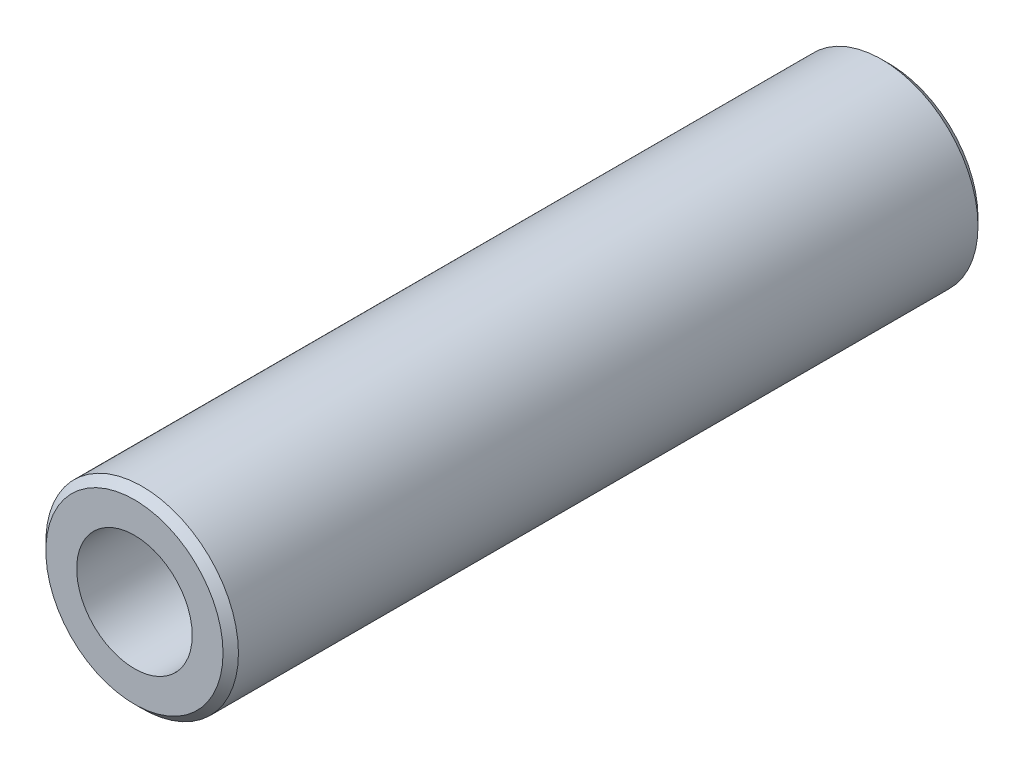
ISO-10303-21;
HEADER;
FILE_DESCRIPTION(('STEP AP214'),'2;1');
FILE_NAME('part.step','',(''),(''),'','','');
FILE_SCHEMA(('AUTOMOTIVE_DESIGN { 1 0 10303 214 1 1 1 1 }'));
ENDSEC;
DATA;
#1=APPLICATION_CONTEXT('core data for automotive mechanical design processes');
#2=APPLICATION_PROTOCOL_DEFINITION('international standard','automotive_design',2000,#1);
#3=PRODUCT_CONTEXT('',#1,'mechanical');
#4=PRODUCT('Part','Part','',(#3));
#5=PRODUCT_RELATED_PRODUCT_CATEGORY('part','',(#4));
#6=PRODUCT_DEFINITION_FORMATION('','',#4);
#7=PRODUCT_DEFINITION_CONTEXT('part definition',#1,'design');
#8=PRODUCT_DEFINITION('design','',#6,#7);
#9=PRODUCT_DEFINITION_SHAPE('','',#8);
#10=(LENGTH_UNIT() NAMED_UNIT(*) SI_UNIT(.MILLI.,.METRE.));
#11=(NAMED_UNIT(*) PLANE_ANGLE_UNIT() SI_UNIT($,.RADIAN.));
#12=(NAMED_UNIT(*) SI_UNIT($,.STERADIAN.) SOLID_ANGLE_UNIT());
#13=UNCERTAINTY_MEASURE_WITH_UNIT(LENGTH_MEASURE(1.E-05),#10,'distance_accuracy_value','');
#14=(GEOMETRIC_REPRESENTATION_CONTEXT(3) GLOBAL_UNCERTAINTY_ASSIGNED_CONTEXT((#13)) GLOBAL_UNIT_ASSIGNED_CONTEXT((#10,
#11,#12)) REPRESENTATION_CONTEXT('',''));
#15=CARTESIAN_POINT('',(0.,0.,0.));
#16=DIRECTION('',(0.,0.,1.));
#17=DIRECTION('',(1.,0.,0.));
#18=AXIS2_PLACEMENT_3D('',#15,#16,#17);
#19=CARTESIAN_POINT('',(0.,0.,24.5));
#20=DIRECTION('',(0.,0.,1.));
#21=DIRECTION('',(1.,0.,0.));
#22=AXIS2_PLACEMENT_3D('',#19,#20,#21);
#23=PLANE('',#22);
#24=CARTESIAN_POINT('',(0.,0.,24.5));
#25=DIRECTION('',(0.,0.,1.));
#26=DIRECTION('',(1.,0.,0.));
#27=AXIS2_PLACEMENT_3D('',#24,#25,#26);
#28=CIRCLE('',#27,5.75);
#29=CARTESIAN_POINT('',(5.75,0.,24.5));
#30=VERTEX_POINT('',#29);
#31=EDGE_CURVE('E11',#30,#30,#28,.T.);
#32=ORIENTED_EDGE('',*,*,#31,.T.);
#33=EDGE_LOOP('',(#32));
#34=FACE_BOUND('',#33,.T.);
#35=CARTESIAN_POINT('',(0.,0.,24.5));
#36=DIRECTION('',(0.,0.,1.));
#37=DIRECTION('',(1.,0.,0.));
#38=AXIS2_PLACEMENT_3D('',#35,#36,#37);
#39=CIRCLE('',#38,3.75);
#40=CARTESIAN_POINT('',(3.75,0.,24.5));
#41=VERTEX_POINT('',#40);
#42=EDGE_CURVE('E57',#41,#41,#39,.T.);
#43=ORIENTED_EDGE('',*,*,#42,.F.);
#44=EDGE_LOOP('',(#43));
#45=FACE_BOUND('',#44,.T.);
#46=ADVANCED_FACE('F37',(#34,#45),#23,.T.);
#47=CARTESIAN_POINT('',(0.,0.,-24.5));
#48=DIRECTION('',(0.,0.,1.));
#49=DIRECTION('',(1.,0.,0.));
#50=AXIS2_PLACEMENT_3D('',#47,#48,#49);
#51=PLANE('',#50);
#52=CARTESIAN_POINT('',(0.,0.,-24.5));
#53=DIRECTION('',(0.,0.,1.));
#54=DIRECTION('',(1.,0.,0.));
#55=AXIS2_PLACEMENT_3D('',#52,#53,#54);
#56=CIRCLE('',#55,5.75);
#57=CARTESIAN_POINT('',(5.75,0.,-24.5));
#58=VERTEX_POINT('',#57);
#59=EDGE_CURVE('E44',#58,#58,#56,.F.);
#60=ORIENTED_EDGE('',*,*,#59,.T.);
#61=EDGE_LOOP('',(#60));
#62=FACE_BOUND('',#61,.T.);
#63=CARTESIAN_POINT('',(0.,0.,-24.5));
#64=DIRECTION('',(0.,0.,1.));
#65=DIRECTION('',(1.,0.,0.));
#66=AXIS2_PLACEMENT_3D('',#63,#64,#65);
#67=CIRCLE('',#66,3.75);
#68=CARTESIAN_POINT('',(3.75,0.,-24.5));
#69=VERTEX_POINT('',#68);
#70=EDGE_CURVE('E58',#69,#69,#67,.T.);
#71=ORIENTED_EDGE('',*,*,#70,.T.);
#72=EDGE_LOOP('',(#71));
#73=FACE_BOUND('',#72,.T.);
#74=ADVANCED_FACE('F68',(#62,#73),#51,.F.);
#75=CARTESIAN_POINT('',(0.,0.,24.5));
#76=DIRECTION('',(0.,0.,-1.));
#77=DIRECTION('',(-1.,0.,0.));
#78=AXIS2_PLACEMENT_3D('',#75,#76,#77);
#79=CYLINDRICAL_SURFACE('',#78,6.25);
#80=CARTESIAN_POINT('',(0.,0.,-24.));
#81=DIRECTION('',(0.,0.,1.));
#82=DIRECTION('',(1.,0.,0.));
#83=AXIS2_PLACEMENT_3D('',#80,#81,#82);
#84=CIRCLE('',#83,6.25);
#85=CARTESIAN_POINT('',(6.25,0.,-24.));
#86=VERTEX_POINT('',#85);
#87=EDGE_CURVE('E48',#86,#86,#84,.T.);
#88=ORIENTED_EDGE('',*,*,#87,.T.);
#89=EDGE_LOOP('',(#88));
#90=FACE_BOUND('',#89,.T.);
#91=CARTESIAN_POINT('',(0.,0.,24.));
#92=DIRECTION('',(0.,0.,1.));
#93=DIRECTION('',(1.,0.,0.));
#94=AXIS2_PLACEMENT_3D('',#91,#92,#93);
#95=CIRCLE('',#94,6.25);
#96=CARTESIAN_POINT('',(6.25,0.,24.));
#97=VERTEX_POINT('',#96);
#98=EDGE_CURVE('E52',#97,#97,#95,.F.);
#99=ORIENTED_EDGE('',*,*,#98,.T.);
#100=EDGE_LOOP('',(#99));
#101=FACE_BOUND('',#100,.T.);
#102=ADVANCED_FACE('F73',(#90,#101),#79,.T.);
#103=CARTESIAN_POINT('',(0.,0.,24.5));
#104=DIRECTION('',(0.,0.,-1.));
#105=DIRECTION('',(-1.,0.,0.));
#106=AXIS2_PLACEMENT_3D('',#103,#104,#105);
#107=CYLINDRICAL_SURFACE('',#106,3.75);
#108=ORIENTED_EDGE('',*,*,#42,.T.);
#109=EDGE_LOOP('',(#108));
#110=FACE_BOUND('',#109,.T.);
#111=ORIENTED_EDGE('',*,*,#70,.F.);
#112=EDGE_LOOP('',(#111));
#113=FACE_BOUND('',#112,.T.);
#114=ADVANCED_FACE('F64',(#110,#113),#107,.F.);
#115=CARTESIAN_POINT('',(0.,0.,-24.));
#116=DIRECTION('',(0.,0.,1.));
#117=DIRECTION('',(1.,0.,0.));
#118=AXIS2_PLACEMENT_3D('',#115,#116,#117);
#119=CONICAL_SURFACE('',#118,6.25,0.785398163397455);
#120=ORIENTED_EDGE('',*,*,#59,.F.);
#121=EDGE_LOOP('',(#120));
#122=FACE_BOUND('',#121,.T.);
#123=ORIENTED_EDGE('',*,*,#87,.F.);
#124=EDGE_LOOP('',(#123));
#125=FACE_BOUND('',#124,.T.);
#126=ADVANCED_FACE('F79',(#122,#125),#119,.T.);
#127=CARTESIAN_POINT('',(0.,0.,24.5));
#128=DIRECTION('',(0.,0.,-1.));
#129=DIRECTION('',(-1.,0.,0.));
#130=AXIS2_PLACEMENT_3D('',#127,#128,#129);
#131=CONICAL_SURFACE('',#130,5.75,0.785398163397447);
#132=ORIENTED_EDGE('',*,*,#98,.F.);
#133=EDGE_LOOP('',(#132));
#134=FACE_BOUND('',#133,.T.);
#135=ORIENTED_EDGE('',*,*,#31,.F.);
#136=EDGE_LOOP('',(#135));
#137=FACE_BOUND('',#136,.T.);
#138=ADVANCED_FACE('F39',(#134,#137),#131,.T.);
#139=CLOSED_SHELL('',(#46,#74,#102,#114,#126,#138));
#140=MANIFOLD_SOLID_BREP('B2',#139);
#141=ADVANCED_BREP_SHAPE_REPRESENTATION('',(#18,#140),#14);
#142=SHAPE_DEFINITION_REPRESENTATION(#9,#141);
ENDSEC;
END-ISO-10303-21;
